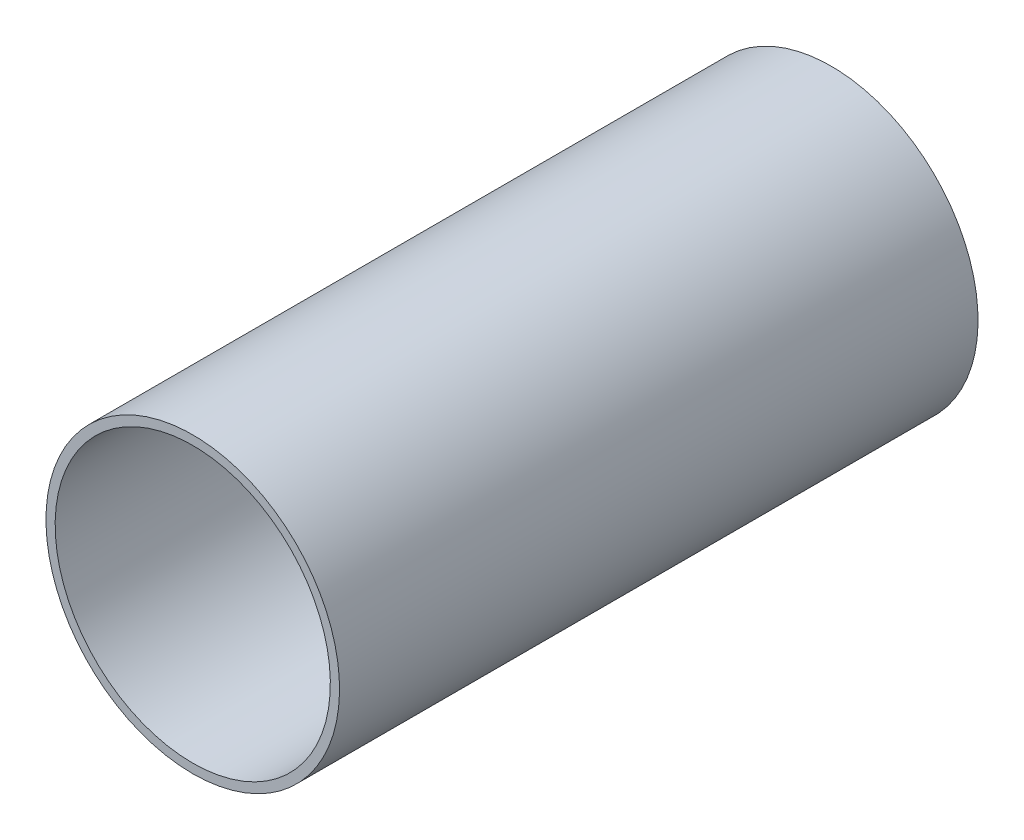
ISO-10303-21;
HEADER;
FILE_DESCRIPTION(('STEP AP214'),'2;1');
FILE_NAME('part.step','',(''),(''),'','','');
FILE_SCHEMA(('AUTOMOTIVE_DESIGN { 1 0 10303 214 1 1 1 1 }'));
ENDSEC;
DATA;
#1=APPLICATION_CONTEXT('core data for automotive mechanical design processes');
#2=APPLICATION_PROTOCOL_DEFINITION('international standard','automotive_design',2000,#1);
#3=PRODUCT_CONTEXT('',#1,'mechanical');
#4=PRODUCT('Part','Part','',(#3));
#5=PRODUCT_RELATED_PRODUCT_CATEGORY('part','',(#4));
#6=PRODUCT_DEFINITION_FORMATION('','',#4);
#7=PRODUCT_DEFINITION_CONTEXT('part definition',#1,'design');
#8=PRODUCT_DEFINITION('design','',#6,#7);
#9=PRODUCT_DEFINITION_SHAPE('','',#8);
#10=(LENGTH_UNIT() NAMED_UNIT(*) SI_UNIT(.MILLI.,.METRE.));
#11=(NAMED_UNIT(*) PLANE_ANGLE_UNIT() SI_UNIT($,.RADIAN.));
#12=(NAMED_UNIT(*) SI_UNIT($,.STERADIAN.) SOLID_ANGLE_UNIT());
#13=UNCERTAINTY_MEASURE_WITH_UNIT(LENGTH_MEASURE(1.E-05),#10,'distance_accuracy_value','');
#14=(GEOMETRIC_REPRESENTATION_CONTEXT(3) GLOBAL_UNCERTAINTY_ASSIGNED_CONTEXT((#13)) GLOBAL_UNIT_ASSIGNED_CONTEXT((#10,
#11,#12)) REPRESENTATION_CONTEXT('',''));
#15=CARTESIAN_POINT('',(0.,0.,0.));
#16=DIRECTION('',(0.,0.,1.));
#17=DIRECTION('',(1.,0.,0.));
#18=AXIS2_PLACEMENT_3D('',#15,#16,#17);
#19=CARTESIAN_POINT('',(117.856,-127.896,-0.045));
#20=DIRECTION('',(0.,0.,-1.));
#21=DIRECTION('',(0.,-1.,0.));
#22=AXIS2_PLACEMENT_3D('',#19,#20,#21);
#23=CYLINDRICAL_SURFACE('',#22,0.375);
#24=CARTESIAN_POINT('',(117.856,-127.896,-0.035));
#25=DIRECTION('',(0.,0.,-1.));
#26=DIRECTION('',(0.,-1.,0.));
#27=AXIS2_PLACEMENT_3D('',#24,#25,#26);
#28=CIRCLE('',#27,0.375);
#29=CARTESIAN_POINT('',(117.856,-128.271,-0.035));
#30=VERTEX_POINT('',#29);
#31=EDGE_CURVE('E65',#30,#30,#28,.T.);
#32=ORIENTED_EDGE('',*,*,#31,.T.);
#33=DIRECTION('',(0.,0.,1.));
#34=VECTOR('',#33,1.);
#35=CARTESIAN_POINT('',(117.856,-128.271,-0.045));
#36=LINE('',#35,#34);
#37=CARTESIAN_POINT('',(117.856,-128.271,1.705));
#38=VERTEX_POINT('',#37);
#39=EDGE_CURVE('E11',#30,#38,#36,.T.);
#40=ORIENTED_EDGE('',*,*,#39,.T.);
#41=CARTESIAN_POINT('',(117.856,-127.896,1.705));
#42=DIRECTION('',(0.,0.,-1.));
#43=DIRECTION('',(0.,-1.,0.));
#44=AXIS2_PLACEMENT_3D('',#41,#42,#43);
#45=CIRCLE('',#44,0.375);
#46=EDGE_CURVE('E20',#38,#38,#45,.T.);
#47=ORIENTED_EDGE('',*,*,#46,.F.);
#48=ORIENTED_EDGE('',*,*,#39,.F.);
#49=EDGE_LOOP('',(#32,#40,#47,#48));
#50=FACE_BOUND('',#49,.T.);
#51=ADVANCED_FACE('F17',(#50),#23,.F.);
#52=CARTESIAN_POINT('',(117.856,-128.296,1.705));
#53=DIRECTION('',(0.,0.,1.));
#54=DIRECTION('',(1.,0.,0.));
#55=AXIS2_PLACEMENT_3D('',#52,#53,#54);
#56=PLANE('',#55);
#57=ORIENTED_EDGE('',*,*,#46,.T.);
#58=EDGE_LOOP('',(#57));
#59=FACE_BOUND('',#58,.T.);
#60=CARTESIAN_POINT('',(117.856,-127.896,1.705));
#61=DIRECTION('',(0.,0.,1.));
#62=DIRECTION('',(0.,-1.,0.));
#63=AXIS2_PLACEMENT_3D('',#60,#61,#62);
#64=CIRCLE('',#63,0.4);
#65=CARTESIAN_POINT('',(117.856,-128.296,1.705));
#66=VERTEX_POINT('',#65);
#67=EDGE_CURVE('E57',#66,#66,#64,.T.);
#68=ORIENTED_EDGE('',*,*,#67,.T.);
#69=EDGE_LOOP('',(#68));
#70=FACE_BOUND('',#69,.T.);
#71=ADVANCED_FACE('F76',(#59,#70),#56,.T.);
#72=CARTESIAN_POINT('',(117.856,-128.296,-0.035));
#73=DIRECTION('',(0.,0.,1.));
#74=DIRECTION('',(1.,0.,0.));
#75=AXIS2_PLACEMENT_3D('',#72,#73,#74);
#76=PLANE('',#75);
#77=ORIENTED_EDGE('',*,*,#31,.F.);
#78=EDGE_LOOP('',(#77));
#79=FACE_BOUND('',#78,.T.);
#80=CARTESIAN_POINT('',(117.856,-127.896,-0.035));
#81=DIRECTION('',(0.,0.,1.));
#82=DIRECTION('',(0.,-1.,0.));
#83=AXIS2_PLACEMENT_3D('',#80,#81,#82);
#84=CIRCLE('',#83,0.4);
#85=CARTESIAN_POINT('',(117.856,-128.296,-0.035));
#86=VERTEX_POINT('',#85);
#87=EDGE_CURVE('E56',#86,#86,#84,.T.);
#88=ORIENTED_EDGE('',*,*,#87,.F.);
#89=EDGE_LOOP('',(#88));
#90=FACE_BOUND('',#89,.T.);
#91=ADVANCED_FACE('F84',(#79,#90),#76,.F.);
#92=CARTESIAN_POINT('',(117.856,-127.896,-0.035));
#93=DIRECTION('',(0.,0.,-1.));
#94=DIRECTION('',(0.,-1.,0.));
#95=AXIS2_PLACEMENT_3D('',#92,#93,#94);
#96=CYLINDRICAL_SURFACE('',#95,0.4);
#97=ORIENTED_EDGE('',*,*,#87,.T.);
#98=DIRECTION('',(0.,0.,1.));
#99=VECTOR('',#98,1.);
#100=CARTESIAN_POINT('',(117.856,-128.296,-0.035));
#101=LINE('',#100,#99);
#102=EDGE_CURVE('E53',#86,#66,#101,.T.);
#103=ORIENTED_EDGE('',*,*,#102,.T.);
#104=ORIENTED_EDGE('',*,*,#67,.F.);
#105=ORIENTED_EDGE('',*,*,#102,.F.);
#106=EDGE_LOOP('',(#97,#103,#104,#105));
#107=FACE_BOUND('',#106,.T.);
#108=ADVANCED_FACE('F54',(#107),#96,.T.);
#109=CLOSED_SHELL('',(#51,#71,#91,#108));
#110=MANIFOLD_SOLID_BREP('B1',#109);
#111=ADVANCED_BREP_SHAPE_REPRESENTATION('',(#18,#110),#14);
#112=SHAPE_DEFINITION_REPRESENTATION(#9,#111);
ENDSEC;
END-ISO-10303-21;
